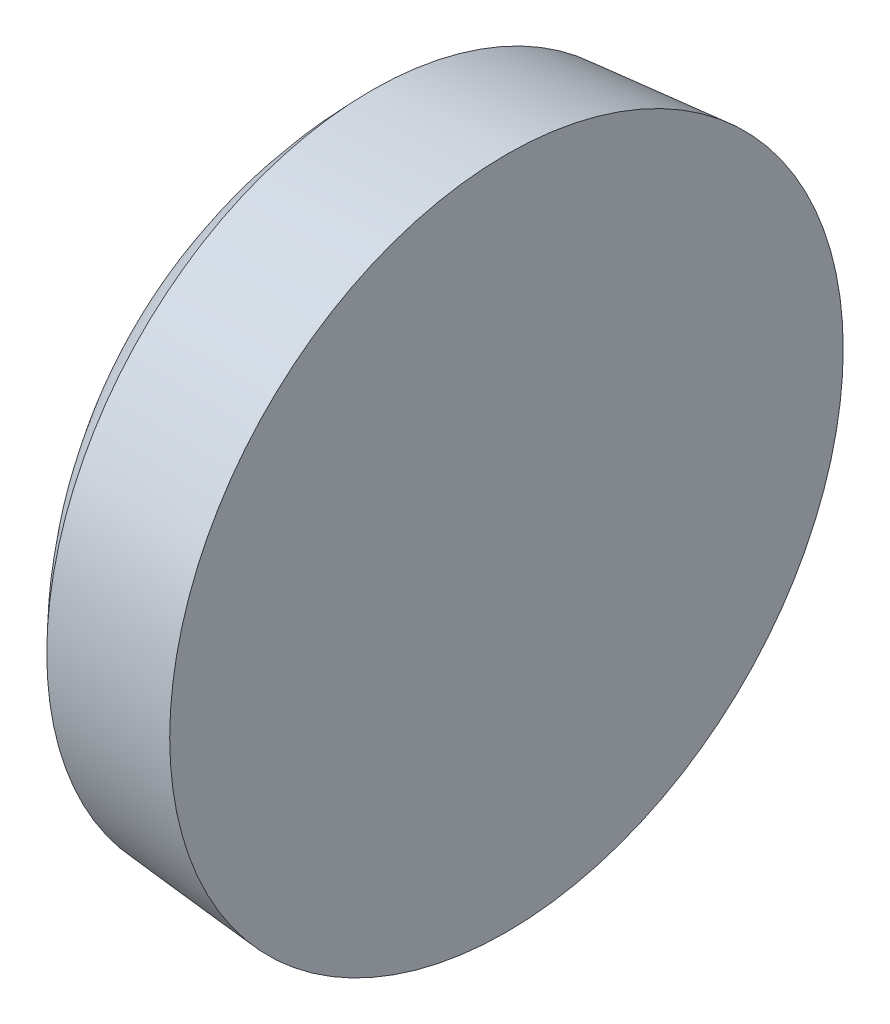
ISO-10303-21;
HEADER;
FILE_DESCRIPTION(('STEP AP214'),'2;1');
FILE_NAME('part.step','',(''),(''),'','','');
FILE_SCHEMA(('AUTOMOTIVE_DESIGN { 1 0 10303 214 1 1 1 1 }'));
ENDSEC;
DATA;
#1=APPLICATION_CONTEXT('core data for automotive mechanical design processes');
#2=APPLICATION_PROTOCOL_DEFINITION('international standard','automotive_design',2000,#1);
#3=PRODUCT_CONTEXT('',#1,'mechanical');
#4=PRODUCT('Part','Part','',(#3));
#5=PRODUCT_RELATED_PRODUCT_CATEGORY('part','',(#4));
#6=PRODUCT_DEFINITION_FORMATION('','',#4);
#7=PRODUCT_DEFINITION_CONTEXT('part definition',#1,'design');
#8=PRODUCT_DEFINITION('design','',#6,#7);
#9=PRODUCT_DEFINITION_SHAPE('','',#8);
#10=(LENGTH_UNIT() NAMED_UNIT(*) SI_UNIT(.MILLI.,.METRE.));
#11=(NAMED_UNIT(*) PLANE_ANGLE_UNIT() SI_UNIT($,.RADIAN.));
#12=(NAMED_UNIT(*) SI_UNIT($,.STERADIAN.) SOLID_ANGLE_UNIT());
#13=UNCERTAINTY_MEASURE_WITH_UNIT(LENGTH_MEASURE(1.E-05),#10,'distance_accuracy_value','');
#14=(GEOMETRIC_REPRESENTATION_CONTEXT(3) GLOBAL_UNCERTAINTY_ASSIGNED_CONTEXT((#13)) GLOBAL_UNIT_ASSIGNED_CONTEXT((#10,
#11,#12)) REPRESENTATION_CONTEXT('',''));
#15=CARTESIAN_POINT('',(0.,0.,0.));
#16=DIRECTION('',(0.,0.,1.));
#17=DIRECTION('',(1.,0.,0.));
#18=AXIS2_PLACEMENT_3D('',#15,#16,#17);
#19=CARTESIAN_POINT('',(71.8666666666667,6.9,10.));
#20=DIRECTION('',(-1.,0.,0.));
#21=DIRECTION('',(0.,0.,1.));
#22=AXIS2_PLACEMENT_3D('',#19,#20,#21);
#23=PLANE('',#22);
#24=DIRECTION('',(0.,0.,-1.));
#25=VECTOR('',#24,1.);
#26=CARTESIAN_POINT('',(71.8666666666667,7.85,10.));
#27=LINE('',#26,#25);
#28=CARTESIAN_POINT('',(71.8666666666667,7.85,9.82));
#29=VERTEX_POINT('',#28);
#30=CARTESIAN_POINT('',(71.8666666666667,7.85,10.18));
#31=VERTEX_POINT('',#30);
#32=EDGE_CURVE('E293',#29,#31,#27,.F.);
#33=ORIENTED_EDGE('',*,*,#32,.F.);
#34=DIRECTION('',(0.,1.,0.));
#35=VECTOR('',#34,1.);
#36=CARTESIAN_POINT('',(71.8666666666667,6.9,9.82));
#37=LINE('',#36,#35);
#38=CARTESIAN_POINT('',(71.8666666666667,7.08,9.82));
#39=VERTEX_POINT('',#38);
#40=EDGE_CURVE('E298',#39,#29,#37,.T.);
#41=ORIENTED_EDGE('',*,*,#40,.F.);
#42=DIRECTION('',(0.,0.,-1.));
#43=VECTOR('',#42,1.);
#44=CARTESIAN_POINT('',(71.8666666666667,7.08,10.));
#45=LINE('',#44,#43);
#46=CARTESIAN_POINT('',(71.8666666666667,7.08,9.05));
#47=VERTEX_POINT('',#46);
#48=EDGE_CURVE('E303',#47,#39,#45,.F.);
#49=ORIENTED_EDGE('',*,*,#48,.F.);
#50=DIRECTION('',(0.,1.,0.));
#51=VECTOR('',#50,1.);
#52=CARTESIAN_POINT('',(71.8666666666667,6.9,9.05));
#53=LINE('',#52,#51);
#54=CARTESIAN_POINT('',(71.8666666666667,6.72,9.05));
#55=VERTEX_POINT('',#54);
#56=EDGE_CURVE('E308',#55,#47,#53,.T.);
#57=ORIENTED_EDGE('',*,*,#56,.F.);
#58=DIRECTION('',(0.,0.,1.));
#59=VECTOR('',#58,1.);
#60=CARTESIAN_POINT('',(71.8666666666667,6.72,10.));
#61=LINE('',#60,#59);
#62=CARTESIAN_POINT('',(71.8666666666667,6.72,9.82));
#63=VERTEX_POINT('',#62);
#64=EDGE_CURVE('E313',#63,#55,#61,.F.);
#65=ORIENTED_EDGE('',*,*,#64,.F.);
#66=DIRECTION('',(0.,1.,0.));
#67=VECTOR('',#66,1.);
#68=CARTESIAN_POINT('',(71.8666666666667,6.9,9.82));
#69=LINE('',#68,#67);
#70=CARTESIAN_POINT('',(71.8666666666667,5.95,9.82));
#71=VERTEX_POINT('',#70);
#72=EDGE_CURVE('E318',#71,#63,#69,.T.);
#73=ORIENTED_EDGE('',*,*,#72,.F.);
#74=DIRECTION('',(0.,0.,-1.));
#75=VECTOR('',#74,1.);
#76=CARTESIAN_POINT('',(71.8666666666667,5.95,10.));
#77=LINE('',#76,#75);
#78=CARTESIAN_POINT('',(71.8666666666667,5.95,10.18));
#79=VERTEX_POINT('',#78);
#80=EDGE_CURVE('E267',#71,#79,#77,.F.);
#81=ORIENTED_EDGE('',*,*,#80,.T.);
#82=DIRECTION('',(0.,1.,0.));
#83=VECTOR('',#82,1.);
#84=CARTESIAN_POINT('',(71.8666666666667,6.9,10.18));
#85=LINE('',#84,#83);
#86=CARTESIAN_POINT('',(71.8666666666667,6.72,10.18));
#87=VERTEX_POINT('',#86);
#88=EDGE_CURVE('E264',#87,#79,#85,.F.);
#89=ORIENTED_EDGE('',*,*,#88,.F.);
#90=DIRECTION('',(0.,0.,1.));
#91=VECTOR('',#90,1.);
#92=CARTESIAN_POINT('',(71.8666666666667,6.72,10.));
#93=LINE('',#92,#91);
#94=CARTESIAN_POINT('',(71.8666666666667,6.72,10.95));
#95=VERTEX_POINT('',#94);
#96=EDGE_CURVE('E260',#95,#87,#93,.F.);
#97=ORIENTED_EDGE('',*,*,#96,.F.);
#98=DIRECTION('',(0.,1.,0.));
#99=VECTOR('',#98,1.);
#100=CARTESIAN_POINT('',(71.8666666666667,6.9,10.95));
#101=LINE('',#100,#99);
#102=CARTESIAN_POINT('',(71.8666666666667,7.08,10.95));
#103=VERTEX_POINT('',#102);
#104=EDGE_CURVE('E231',#95,#103,#101,.T.);
#105=ORIENTED_EDGE('',*,*,#104,.T.);
#106=DIRECTION('',(0.,0.,-1.));
#107=VECTOR('',#106,1.);
#108=CARTESIAN_POINT('',(71.8666666666667,7.08,10.));
#109=LINE('',#108,#107);
#110=CARTESIAN_POINT('',(71.8666666666667,7.08,10.18));
#111=VERTEX_POINT('',#110);
#112=EDGE_CURVE('E278',#111,#103,#109,.F.);
#113=ORIENTED_EDGE('',*,*,#112,.F.);
#114=DIRECTION('',(0.,1.,0.));
#115=VECTOR('',#114,1.);
#116=CARTESIAN_POINT('',(71.8666666666667,6.9,10.18));
#117=LINE('',#116,#115);
#118=EDGE_CURVE('E288',#31,#111,#117,.F.);
#119=ORIENTED_EDGE('',*,*,#118,.F.);
#120=EDGE_LOOP('',(#33,#41,#49,#57,#65,#73,#81,#89,#97,#105,#113,#119));
#121=FACE_BOUND('',#120,.T.);
#122=ADVANCED_FACE('F17',(#121),#23,.T.);
#123=CARTESIAN_POINT('',(71.2666666666667,6.72,10.));
#124=DIRECTION('',(0.,1.,0.));
#125=DIRECTION('',(0.,0.,1.));
#126=AXIS2_PLACEMENT_3D('',#123,#124,#125);
#127=PLANE('',#126);
#128=DIRECTION('',(1.,0.,0.));
#129=VECTOR('',#128,1.);
#130=CARTESIAN_POINT('',(71.2666666666667,6.72,10.95));
#131=LINE('',#130,#129);
#132=CARTESIAN_POINT('',(70.8437621434756,6.72,10.95));
#133=VERTEX_POINT('',#132);
#134=EDGE_CURVE('E89',#133,#95,#131,.T.);
#135=ORIENTED_EDGE('',*,*,#134,.T.);
#136=ORIENTED_EDGE('',*,*,#96,.T.);
#137=DIRECTION('',(-1.,0.,0.));
#138=VECTOR('',#137,1.);
#139=CARTESIAN_POINT('',(71.2666666666667,6.72,10.18));
#140=LINE('',#139,#138);
#141=CARTESIAN_POINT('',(70.6785690968727,6.72,10.18));
#142=VERTEX_POINT('',#141);
#143=EDGE_CURVE('E224',#142,#87,#140,.F.);
#144=ORIENTED_EDGE('',*,*,#143,.F.);
#145=CARTESIAN_POINT('',(70.8437621434756,6.72,10.95));
#146=CARTESIAN_POINT('',(70.8322171292822,6.72,10.9189995540506));
#147=CARTESIAN_POINT('',(70.8212377468981,6.72,10.8877884938067));
#148=CARTESIAN_POINT('',(70.8004645483596,6.72,10.8251104536469));
#149=CARTESIAN_POINT('',(70.7906662413493,6.72,10.7936449620741));
#150=CARTESIAN_POINT('',(70.7722427007091,6.72,10.7304618501356));
#151=CARTESIAN_POINT('',(70.7636144610796,6.72,10.6987451062672));
#152=CARTESIAN_POINT('',(70.747522711913,6.72,10.6350619663155));
#153=CARTESIAN_POINT('',(70.7400576830911,6.72,10.6030959541242));
#154=CARTESIAN_POINT('',(70.7262885047045,6.72,10.5389148788568));
#155=CARTESIAN_POINT('',(70.7199843551398,6.72,10.5066998157808));
#156=CARTESIAN_POINT('',(70.7085376077745,6.72,10.4420201537524));
#157=CARTESIAN_POINT('',(70.7033965530294,6.72,10.4095552817086));
#158=CARTESIAN_POINT('',(70.6942815043555,6.72,10.3443751591893));
#159=CARTESIAN_POINT('',(70.6903106114274,6.72,10.3116594750372));
#160=CARTESIAN_POINT('',(70.6835456245179,6.72,10.2459761632456));
#161=CARTESIAN_POINT('',(70.6807562366993,6.72,10.2130080508538));
#162=CARTESIAN_POINT('',(70.6785690968726,6.72,10.18));
#163=B_SPLINE_CURVE_WITH_KNOTS('',3,(#145,#146,#147,#148,#149,#150,#151,#152,#153,#154,#155,
#156,#157,#158,#159,#160,#161,#162),.UNSPECIFIED.,.F.,.F.,(4,2,2,2,2,2,2,2,4),(0.,
0.0992357442434171,0.198081387639275,0.296668072480497,0.395124892694101,0.493581712907701,
0.592168397748929,0.691014041144783,0.790249785388203),.UNSPECIFIED.);
#164=EDGE_CURVE('E20',#133,#142,#163,.T.);
#165=ORIENTED_EDGE('',*,*,#164,.F.);
#166=EDGE_LOOP('',(#135,#136,#144,#165));
#167=FACE_BOUND('',#166,.T.);
#168=ADVANCED_FACE('F221',(#167),#127,.T.);
#169=CARTESIAN_POINT('',(71.2666666666667,6.9,10.18));
#170=DIRECTION('',(0.,0.,-1.));
#171=DIRECTION('',(-1.,0.,0.));
#172=AXIS2_PLACEMENT_3D('',#169,#170,#171);
#173=PLANE('',#172);
#174=ORIENTED_EDGE('',*,*,#88,.T.);
#175=DIRECTION('',(1.,0.,0.));
#176=VECTOR('',#175,1.);
#177=CARTESIAN_POINT('',(71.2666666666667,5.95,10.18));
#178=LINE('',#177,#176);
#179=CARTESIAN_POINT('',(70.8437621434756,5.95,10.18));
#180=VERTEX_POINT('',#179);
#181=EDGE_CURVE('E324',#79,#180,#178,.F.);
#182=ORIENTED_EDGE('',*,*,#181,.T.);
#183=CARTESIAN_POINT('',(70.6785690968726,6.71999999999999,10.18));
#184=CARTESIAN_POINT('',(70.6842232755615,6.63440991744418,10.18));
#185=CARTESIAN_POINT('',(70.6939547629615,6.54909652262231,10.18));
#186=CARTESIAN_POINT('',(70.721321880478,6.38034093840231,10.18));
#187=CARTESIAN_POINT('',(70.7389034345171,6.29688998051804,10.18));
#188=CARTESIAN_POINT('',(70.7836325640795,6.12495750840954,10.18));
#189=CARTESIAN_POINT('',(70.8114686271752,6.03665468899654,10.18));
#190=CARTESIAN_POINT('',(70.8437621434756,5.94999999999999,10.18));
#191=B_SPLINE_CURVE_WITH_KNOTS('',3,(#183,#184,#185,#186,#187,#188,#189,#190),.UNSPECIFIED.,.F.,
.F.,(4,2,2,4),(0.,0.257221658829344,0.512698117737358,0.789983486231619),.UNSPECIFIED.);
#192=EDGE_CURVE('E213',#142,#180,#191,.T.);
#193=ORIENTED_EDGE('',*,*,#192,.F.);
#194=ORIENTED_EDGE('',*,*,#143,.T.);
#195=EDGE_LOOP('',(#174,#182,#193,#194));
#196=FACE_BOUND('',#195,.T.);
#197=ADVANCED_FACE('F204',(#196),#173,.T.);
#198=CARTESIAN_POINT('',(71.2666666666667,5.95,10.));
#199=DIRECTION('',(0.,-1.,0.));
#200=DIRECTION('',(0.,0.,-1.));
#201=AXIS2_PLACEMENT_3D('',#198,#199,#200);
#202=PLANE('',#201);
#203=ORIENTED_EDGE('',*,*,#181,.F.);
#204=ORIENTED_EDGE('',*,*,#80,.F.);
#205=DIRECTION('',(1.,0.,0.));
#206=VECTOR('',#205,1.);
#207=CARTESIAN_POINT('',(71.2666666666667,5.95,9.82));
#208=LINE('',#207,#206);
#209=CARTESIAN_POINT('',(70.8437621434756,5.94999999999999,9.82));
#210=VERTEX_POINT('',#209);
#211=EDGE_CURVE('E320',#210,#71,#208,.T.);
#212=ORIENTED_EDGE('',*,*,#211,.F.);
#213=CARTESIAN_POINT('',(70.8437621434756,5.95,10.18));
#214=CARTESIAN_POINT('',(70.8395337477772,5.94999999999998,10.12));
#215=CARTESIAN_POINT('',(70.8374195499281,5.94999999999998,10.06));
#216=CARTESIAN_POINT('',(70.8374195499281,5.95000000000002,9.93999999999996));
#217=CARTESIAN_POINT('',(70.8395337477772,5.95000000000006,9.87999999999995));
#218=CARTESIAN_POINT('',(70.8437621434755,5.95000000000011,9.81999999999994));
#219=B_SPLINE_CURVE_WITH_KNOTS('',3,(#213,#214,#215,#216,#217,#218),.UNSPECIFIED.,.F.,.F.,(4,2,
4),(0.,0.18011171114872,0.360223422297441),.UNSPECIFIED.);
#220=EDGE_CURVE('E207',#180,#210,#219,.T.);
#221=ORIENTED_EDGE('',*,*,#220,.F.);
#222=EDGE_LOOP('',(#203,#204,#212,#221));
#223=FACE_BOUND('',#222,.T.);
#224=ADVANCED_FACE('F199',(#223),#202,.F.);
#225=CARTESIAN_POINT('',(71.2666666666667,6.9,9.82));
#226=DIRECTION('',(0.,0.,1.));
#227=DIRECTION('',(1.,0.,0.));
#228=AXIS2_PLACEMENT_3D('',#225,#226,#227);
#229=PLANE('',#228);
#230=ORIENTED_EDGE('',*,*,#72,.T.);
#231=DIRECTION('',(1.,0.,0.));
#232=VECTOR('',#231,1.);
#233=CARTESIAN_POINT('',(71.2666666666667,6.72,9.82));
#234=LINE('',#233,#232);
#235=CARTESIAN_POINT('',(70.6785690968727,6.72,9.82));
#236=VERTEX_POINT('',#235);
#237=EDGE_CURVE('E315',#236,#63,#234,.T.);
#238=ORIENTED_EDGE('',*,*,#237,.F.);
#239=CARTESIAN_POINT('',(70.8437621434756,5.94999999999999,9.82));
#240=CARTESIAN_POINT('',(70.8322171292822,5.98100044594941,9.82));
#241=CARTESIAN_POINT('',(70.8212377468981,6.01221150619326,9.82));
#242=CARTESIAN_POINT('',(70.8004645483596,6.07488954635315,9.82));
#243=CARTESIAN_POINT('',(70.7906662413493,6.10635503792594,9.82));
#244=CARTESIAN_POINT('',(70.7722427007091,6.1695381498644,9.82));
#245=CARTESIAN_POINT('',(70.7636144610796,6.20125489373276,9.82));
#246=CARTESIAN_POINT('',(70.747522711913,6.26493803368449,9.82));
#247=CARTESIAN_POINT('',(70.7400576830911,6.29690404587581,9.82));
#248=CARTESIAN_POINT('',(70.7262885047045,6.36108512114316,9.82));
#249=CARTESIAN_POINT('',(70.7199843551398,6.3933001842192,9.82));
#250=CARTESIAN_POINT('',(70.7085376077745,6.45797984624761,9.82));
#251=CARTESIAN_POINT('',(70.7033965530294,6.49044471829143,9.82));
#252=CARTESIAN_POINT('',(70.6942815043555,6.55562484081068,9.82));
#253=CARTESIAN_POINT('',(70.6903106114274,6.58834052496277,9.82));
#254=CARTESIAN_POINT('',(70.6835456245179,6.65402383675439,9.82));
#255=CARTESIAN_POINT('',(70.6807562366993,6.68699194914621,9.82));
#256=CARTESIAN_POINT('',(70.6785690968726,6.72,9.82));
#257=B_SPLINE_CURVE_WITH_KNOTS('',3,(#239,#240,#241,#242,#243,#244,#245,#246,#247,#248,#249,
#250,#251,#252,#253,#254,#255,#256),.UNSPECIFIED.,.F.,.F.,(4,2,2,2,2,2,2,2,4),(0.,
0.0992357442434187,0.198081387639276,0.2966680724805,0.395124892694102,0.493581712907702,
0.59216839774893,0.691014041144785,0.790249785388205),.UNSPECIFIED.);
#258=EDGE_CURVE('E184',#210,#236,#257,.T.);
#259=ORIENTED_EDGE('',*,*,#258,.F.);
#260=ORIENTED_EDGE('',*,*,#211,.T.);
#261=EDGE_LOOP('',(#230,#238,#259,#260));
#262=FACE_BOUND('',#261,.T.);
#263=ADVANCED_FACE('F194',(#262),#229,.T.);
#264=CARTESIAN_POINT('',(71.2666666666667,6.72,10.));
#265=DIRECTION('',(0.,1.,0.));
#266=DIRECTION('',(0.,0.,1.));
#267=AXIS2_PLACEMENT_3D('',#264,#265,#266);
#268=PLANE('',#267);
#269=DIRECTION('',(1.,0.,0.));
#270=VECTOR('',#269,1.);
#271=CARTESIAN_POINT('',(71.2666666666667,6.72,9.05));
#272=LINE('',#271,#270);
#273=CARTESIAN_POINT('',(70.8437621434756,6.72,9.05));
#274=VERTEX_POINT('',#273);
#275=EDGE_CURVE('E310',#274,#55,#272,.T.);
#276=ORIENTED_EDGE('',*,*,#275,.F.);
#277=CARTESIAN_POINT('',(70.6785690968726,6.72,9.81999999999999));
#278=CARTESIAN_POINT('',(70.6842232755615,6.72,9.73440991744418));
#279=CARTESIAN_POINT('',(70.6939547629615,6.72,9.6490965226223));
#280=CARTESIAN_POINT('',(70.721321880478,6.72,9.48034093840231));
#281=CARTESIAN_POINT('',(70.7389034345171,6.72,9.39688998051804));
#282=CARTESIAN_POINT('',(70.7836325640795,6.72,9.22495750840954));
#283=CARTESIAN_POINT('',(70.8114686271752,6.72,9.13665468899654));
#284=CARTESIAN_POINT('',(70.8437621434756,6.72,9.04999999999999));
#285=B_SPLINE_CURVE_WITH_KNOTS('',3,(#277,#278,#279,#280,#281,#282,#283,#284),.UNSPECIFIED.,.F.,
.F.,(4,2,2,4),(0.,0.257221658829345,0.512698117737359,0.789983486231615),.UNSPECIFIED.);
#286=EDGE_CURVE('E176',#236,#274,#285,.T.);
#287=ORIENTED_EDGE('',*,*,#286,.F.);
#288=ORIENTED_EDGE('',*,*,#237,.T.);
#289=ORIENTED_EDGE('',*,*,#64,.T.);
#290=EDGE_LOOP('',(#276,#287,#288,#289));
#291=FACE_BOUND('',#290,.T.);
#292=ADVANCED_FACE('F191',(#291),#268,.T.);
#293=CARTESIAN_POINT('',(71.2666666666667,6.9,9.05));
#294=DIRECTION('',(0.,0.,1.));
#295=DIRECTION('',(1.,0.,0.));
#296=AXIS2_PLACEMENT_3D('',#293,#294,#295);
#297=PLANE('',#296);
#298=DIRECTION('',(1.,0.,0.));
#299=VECTOR('',#298,1.);
#300=CARTESIAN_POINT('',(71.2666666666667,7.08,9.05));
#301=LINE('',#300,#299);
#302=CARTESIAN_POINT('',(70.8437621434756,7.08,9.05));
#303=VERTEX_POINT('',#302);
#304=EDGE_CURVE('E305',#303,#47,#301,.T.);
#305=ORIENTED_EDGE('',*,*,#304,.F.);
#306=CARTESIAN_POINT('',(70.8437621434756,7.08,9.05));
#307=CARTESIAN_POINT('',(70.8374195499281,6.99011174581384,9.05));
#308=CARTESIAN_POINT('',(70.8374195499281,6.9,9.05));
#309=B_SPLINE_CURVE_WITH_KNOTS('',2,(#306,#307,#308),.UNSPECIFIED.,.F.,.F.,(3,3),(0.,1.),.UNSPECIFIED.);
#310=CARTESIAN_POINT('',(70.8374195499281,6.9,9.05));
#311=VERTEX_POINT('',#310);
#312=EDGE_CURVE('E175',#311,#303,#309,.F.);
#313=ORIENTED_EDGE('',*,*,#312,.F.);
#314=CARTESIAN_POINT('',(70.8374195499281,6.9,9.05));
#315=CARTESIAN_POINT('',(70.8374195499281,6.80988825418617,9.05));
#316=CARTESIAN_POINT('',(70.8437621434756,6.72,9.05));
#317=B_SPLINE_CURVE_WITH_KNOTS('',2,(#314,#315,#316),.UNSPECIFIED.,.F.,.F.,(3,3),(0.,1.),.UNSPECIFIED.);
#318=EDGE_CURVE('E183',#274,#311,#317,.F.);
#319=ORIENTED_EDGE('',*,*,#318,.F.);
#320=ORIENTED_EDGE('',*,*,#275,.T.);
#321=ORIENTED_EDGE('',*,*,#56,.T.);
#322=EDGE_LOOP('',(#305,#313,#319,#320,#321));
#323=FACE_BOUND('',#322,.T.);
#324=ADVANCED_FACE('F164',(#323),#297,.T.);
#325=CARTESIAN_POINT('',(71.2666666666667,7.08,10.));
#326=DIRECTION('',(0.,-1.,0.));
#327=DIRECTION('',(0.,0.,-1.));
#328=AXIS2_PLACEMENT_3D('',#325,#326,#327);
#329=PLANE('',#328);
#330=ORIENTED_EDGE('',*,*,#304,.T.);
#331=ORIENTED_EDGE('',*,*,#48,.T.);
#332=DIRECTION('',(1.,0.,0.));
#333=VECTOR('',#332,1.);
#334=CARTESIAN_POINT('',(71.2666666666667,7.08,9.82));
#335=LINE('',#334,#333);
#336=CARTESIAN_POINT('',(70.6785690968727,7.08,9.82));
#337=VERTEX_POINT('',#336);
#338=EDGE_CURVE('E300',#337,#39,#335,.T.);
#339=ORIENTED_EDGE('',*,*,#338,.F.);
#340=CARTESIAN_POINT('',(70.8437621434756,7.08,9.04999999999999));
#341=CARTESIAN_POINT('',(70.8322171292822,7.08,9.08100044594941));
#342=CARTESIAN_POINT('',(70.8212377468981,7.08,9.11221150619326));
#343=CARTESIAN_POINT('',(70.8004645483596,7.08,9.17488954635315));
#344=CARTESIAN_POINT('',(70.7906662413493,7.08,9.20635503792594));
#345=CARTESIAN_POINT('',(70.7722427007091,7.08,9.2695381498644));
#346=CARTESIAN_POINT('',(70.7636144610796,7.08,9.30125489373275));
#347=CARTESIAN_POINT('',(70.747522711913,7.08,9.36493803368449));
#348=CARTESIAN_POINT('',(70.7400576830911,7.08,9.39690404587581));
#349=CARTESIAN_POINT('',(70.7262885047045,7.08,9.46108512114316));
#350=CARTESIAN_POINT('',(70.7199843551398,7.08,9.4933001842192));
#351=CARTESIAN_POINT('',(70.7085376077745,7.08,9.5579798462476));
#352=CARTESIAN_POINT('',(70.7033965530294,7.08,9.59044471829143));
#353=CARTESIAN_POINT('',(70.6942815043555,7.08,9.65562484081068));
#354=CARTESIAN_POINT('',(70.6903106114274,7.08,9.68834052496276));
#355=CARTESIAN_POINT('',(70.6835456245179,7.08,9.75402383675439));
#356=CARTESIAN_POINT('',(70.6807562366993,7.08,9.78699194914621));
#357=CARTESIAN_POINT('',(70.6785690968726,7.08,9.81999999999999));
#358=B_SPLINE_CURVE_WITH_KNOTS('',3,(#340,#341,#342,#343,#344,#345,#346,#347,#348,#349,#350,
#351,#352,#353,#354,#355,#356,#357),.UNSPECIFIED.,.F.,.F.,(4,2,2,2,2,2,2,2,4),(0.,
0.0992357442434171,0.198081387639275,0.296668072480497,0.395124892694099,0.4935817129077,
0.592168397748929,0.691014041144783,0.790249785388203),.UNSPECIFIED.);
#359=EDGE_CURVE('E168',#303,#337,#358,.T.);
#360=ORIENTED_EDGE('',*,*,#359,.F.);
#361=EDGE_LOOP('',(#330,#331,#339,#360));
#362=FACE_BOUND('',#361,.T.);
#363=ADVANCED_FACE('F159',(#362),#329,.T.);
#364=CARTESIAN_POINT('',(71.2666666666667,6.9,9.82));
#365=DIRECTION('',(0.,0.,1.));
#366=DIRECTION('',(1.,0.,0.));
#367=AXIS2_PLACEMENT_3D('',#364,#365,#366);
#368=PLANE('',#367);
#369=ORIENTED_EDGE('',*,*,#40,.T.);
#370=DIRECTION('',(1.,0.,0.));
#371=VECTOR('',#370,1.);
#372=CARTESIAN_POINT('',(71.2666666666667,7.85,9.82));
#373=LINE('',#372,#371);
#374=CARTESIAN_POINT('',(70.8437621434756,7.85,9.82));
#375=VERTEX_POINT('',#374);
#376=EDGE_CURVE('E295',#375,#29,#373,.T.);
#377=ORIENTED_EDGE('',*,*,#376,.F.);
#378=CARTESIAN_POINT('',(70.6785690968726,7.08000000000001,9.82));
#379=CARTESIAN_POINT('',(70.6842232755615,7.16559008255582,9.82));
#380=CARTESIAN_POINT('',(70.6939547629615,7.2509034773777,9.82));
#381=CARTESIAN_POINT('',(70.721321880478,7.41965906159769,9.82));
#382=CARTESIAN_POINT('',(70.7389034345171,7.50311001948196,9.82));
#383=CARTESIAN_POINT('',(70.7836325640795,7.67504249159046,9.82));
#384=CARTESIAN_POINT('',(70.8114686271752,7.76334531100346,9.82));
#385=CARTESIAN_POINT('',(70.8437621434756,7.85000000000001,9.82));
#386=B_SPLINE_CURVE_WITH_KNOTS('',3,(#378,#379,#380,#381,#382,#383,#384,#385),.UNSPECIFIED.,.F.,
.F.,(4,2,2,4),(0.,0.257221658829344,0.512698117737359,0.789983486231618),.UNSPECIFIED.);
#387=EDGE_CURVE('E144',#337,#375,#386,.T.);
#388=ORIENTED_EDGE('',*,*,#387,.F.);
#389=ORIENTED_EDGE('',*,*,#338,.T.);
#390=EDGE_LOOP('',(#369,#377,#388,#389));
#391=FACE_BOUND('',#390,.T.);
#392=ADVANCED_FACE('F154',(#391),#368,.T.);
#393=CARTESIAN_POINT('',(71.2666666666667,7.85,10.));
#394=DIRECTION('',(0.,-1.,0.));
#395=DIRECTION('',(0.,0.,-1.));
#396=AXIS2_PLACEMENT_3D('',#393,#394,#395);
#397=PLANE('',#396);
#398=ORIENTED_EDGE('',*,*,#32,.T.);
#399=DIRECTION('',(-1.,0.,0.));
#400=VECTOR('',#399,1.);
#401=CARTESIAN_POINT('',(71.2666666666667,7.85,10.18));
#402=LINE('',#401,#400);
#403=CARTESIAN_POINT('',(70.8437621434756,7.85,10.18));
#404=VERTEX_POINT('',#403);
#405=EDGE_CURVE('E290',#404,#31,#402,.F.);
#406=ORIENTED_EDGE('',*,*,#405,.F.);
#407=CARTESIAN_POINT('',(70.8437621434756,7.85,9.82));
#408=CARTESIAN_POINT('',(70.8395337477772,7.85000000000001,9.88000000000001));
#409=CARTESIAN_POINT('',(70.8374195499281,7.85000000000001,9.94000000000002));
#410=CARTESIAN_POINT('',(70.8374195499281,7.84999999999999,10.06));
#411=CARTESIAN_POINT('',(70.8395337477772,7.84999999999997,10.1200000000001));
#412=CARTESIAN_POINT('',(70.8437621434755,7.84999999999994,10.1800000000001));
#413=B_SPLINE_CURVE_WITH_KNOTS('',3,(#407,#408,#409,#410,#411,#412),.UNSPECIFIED.,.F.,.F.,(4,2,
4),(0.,0.180111711148723,0.360223422297444),.UNSPECIFIED.);
#414=EDGE_CURVE('E137',#375,#404,#413,.T.);
#415=ORIENTED_EDGE('',*,*,#414,.F.);
#416=ORIENTED_EDGE('',*,*,#376,.T.);
#417=EDGE_LOOP('',(#398,#406,#415,#416));
#418=FACE_BOUND('',#417,.T.);
#419=ADVANCED_FACE('F151',(#418),#397,.T.);
#420=CARTESIAN_POINT('',(71.2666666666667,6.9,10.18));
#421=DIRECTION('',(0.,0.,-1.));
#422=DIRECTION('',(-1.,0.,0.));
#423=AXIS2_PLACEMENT_3D('',#420,#421,#422);
#424=PLANE('',#423);
#425=ORIENTED_EDGE('',*,*,#118,.T.);
#426=DIRECTION('',(1.,0.,0.));
#427=VECTOR('',#426,1.);
#428=CARTESIAN_POINT('',(71.2666666666667,7.08,10.18));
#429=LINE('',#428,#427);
#430=CARTESIAN_POINT('',(70.6785690968727,7.08,10.18));
#431=VERTEX_POINT('',#430);
#432=EDGE_CURVE('E280',#431,#111,#429,.T.);
#433=ORIENTED_EDGE('',*,*,#432,.F.);
#434=CARTESIAN_POINT('',(70.8437621434756,7.85000000000001,10.18));
#435=CARTESIAN_POINT('',(70.8322171292822,7.81899955405059,10.18));
#436=CARTESIAN_POINT('',(70.8212377468981,7.78778849380673,10.18));
#437=CARTESIAN_POINT('',(70.8004645483596,7.72511045364685,10.18));
#438=CARTESIAN_POINT('',(70.7906662413493,7.69364496207406,10.18));
#439=CARTESIAN_POINT('',(70.7722427007091,7.6304618501356,10.18));
#440=CARTESIAN_POINT('',(70.7636144610796,7.59874510626724,10.18));
#441=CARTESIAN_POINT('',(70.747522711913,7.53506196631551,10.18));
#442=CARTESIAN_POINT('',(70.7400576830911,7.50309595412419,10.18));
#443=CARTESIAN_POINT('',(70.7262885047045,7.43891487885684,10.18));
#444=CARTESIAN_POINT('',(70.7199843551398,7.40669981578081,10.18));
#445=CARTESIAN_POINT('',(70.7085376077745,7.3420201537524,10.18));
#446=CARTESIAN_POINT('',(70.7033965530294,7.30955528170858,10.18));
#447=CARTESIAN_POINT('',(70.6942815043555,7.24437515918932,10.18));
#448=CARTESIAN_POINT('',(70.6903106114274,7.21165947503724,10.18));
#449=CARTESIAN_POINT('',(70.6835456245179,7.14597616324561,10.18));
#450=CARTESIAN_POINT('',(70.6807562366993,7.11300805085379,10.18));
#451=CARTESIAN_POINT('',(70.6785690968726,7.08000000000001,10.18));
#452=B_SPLINE_CURVE_WITH_KNOTS('',3,(#434,#435,#436,#437,#438,#439,#440,#441,#442,#443,#444,
#445,#446,#447,#448,#449,#450,#451),.UNSPECIFIED.,.F.,.F.,(4,2,2,2,2,2,2,2,4),(0.,
0.0992357442434187,0.198081387639275,0.296668072480498,0.395124892694101,0.493581712907699,
0.592168397748928,0.691014041144783,0.790249785388203),.UNSPECIFIED.);
#453=EDGE_CURVE('E100',#404,#431,#452,.T.);
#454=ORIENTED_EDGE('',*,*,#453,.F.);
#455=ORIENTED_EDGE('',*,*,#405,.T.);
#456=EDGE_LOOP('',(#425,#433,#454,#455));
#457=FACE_BOUND('',#456,.T.);
#458=ADVANCED_FACE('F123',(#457),#424,.T.);
#459=CARTESIAN_POINT('',(71.2666666666667,7.08,10.));
#460=DIRECTION('',(0.,-1.,0.));
#461=DIRECTION('',(0.,0.,-1.));
#462=AXIS2_PLACEMENT_3D('',#459,#460,#461);
#463=PLANE('',#462);
#464=DIRECTION('',(1.,0.,0.));
#465=VECTOR('',#464,1.);
#466=CARTESIAN_POINT('',(71.2666666666667,7.08,10.95));
#467=LINE('',#466,#465);
#468=CARTESIAN_POINT('',(70.8437621434756,7.08,10.95));
#469=VERTEX_POINT('',#468);
#470=EDGE_CURVE('E40',#103,#469,#467,.F.);
#471=ORIENTED_EDGE('',*,*,#470,.T.);
#472=CARTESIAN_POINT('',(70.6785690968726,7.08,10.18));
#473=CARTESIAN_POINT('',(70.6842232755615,7.08,10.2655900825558));
#474=CARTESIAN_POINT('',(70.6939547629615,7.08,10.3509034773777));
#475=CARTESIAN_POINT('',(70.721321880478,7.08,10.5196590615977));
#476=CARTESIAN_POINT('',(70.7389034345171,7.08,10.603110019482));
#477=CARTESIAN_POINT('',(70.7836325640795,7.08,10.7750424915905));
#478=CARTESIAN_POINT('',(70.8114686271752,7.08,10.8633453110035));
#479=CARTESIAN_POINT('',(70.8437621434756,7.08,10.95));
#480=B_SPLINE_CURVE_WITH_KNOTS('',3,(#472,#473,#474,#475,#476,#477,#478,#479),.UNSPECIFIED.,.F.,
.F.,(4,2,2,4),(0.,0.257221658829345,0.512698117737359,0.78998348623162),.UNSPECIFIED.);
#481=EDGE_CURVE('E96',#431,#469,#480,.T.);
#482=ORIENTED_EDGE('',*,*,#481,.F.);
#483=ORIENTED_EDGE('',*,*,#432,.T.);
#484=ORIENTED_EDGE('',*,*,#112,.T.);
#485=EDGE_LOOP('',(#471,#482,#483,#484));
#486=FACE_BOUND('',#485,.T.);
#487=ADVANCED_FACE('F115',(#486),#463,.T.);
#488=CARTESIAN_POINT('',(71.2666666666667,6.9,10.95));
#489=DIRECTION('',(0.,0.,1.));
#490=DIRECTION('',(1.,0.,0.));
#491=AXIS2_PLACEMENT_3D('',#488,#489,#490);
#492=PLANE('',#491);
#493=ORIENTED_EDGE('',*,*,#470,.F.);
#494=ORIENTED_EDGE('',*,*,#104,.F.);
#495=ORIENTED_EDGE('',*,*,#134,.F.);
#496=CARTESIAN_POINT('',(70.8374195499281,6.9,10.95));
#497=CARTESIAN_POINT('',(70.8374195499281,6.80988825418617,10.95));
#498=CARTESIAN_POINT('',(70.8437621434756,6.72,10.95));
#499=B_SPLINE_CURVE_WITH_KNOTS('',2,(#496,#497,#498),.UNSPECIFIED.,.F.,.F.,(3,3),(0.,1.),.UNSPECIFIED.);
#500=CARTESIAN_POINT('',(70.8374195499281,6.9,10.95));
#501=VERTEX_POINT('',#500);
#502=EDGE_CURVE('E82',#501,#133,#499,.T.);
#503=ORIENTED_EDGE('',*,*,#502,.F.);
#504=CARTESIAN_POINT('',(70.8437621434756,7.08,10.95));
#505=CARTESIAN_POINT('',(70.8374195499281,6.99011174581383,10.95));
#506=CARTESIAN_POINT('',(70.8374195499281,6.9,10.95));
#507=B_SPLINE_CURVE_WITH_KNOTS('',2,(#504,#505,#506),.UNSPECIFIED.,.F.,.F.,(3,3),(0.,1.),.UNSPECIFIED.);
#508=EDGE_CURVE('E85',#469,#501,#507,.T.);
#509=ORIENTED_EDGE('',*,*,#508,.F.);
#510=EDGE_LOOP('',(#493,#494,#495,#503,#509));
#511=FACE_BOUND('',#510,.T.);
#512=ADVANCED_FACE('F84',(#511),#492,.F.);
#513=CARTESIAN_POINT('',(73.394751046113,6.9,10.));
#514=DIRECTION('',(1.,0.,0.));
#515=DIRECTION('',(0.,1.,0.));
#516=AXIS2_PLACEMENT_3D('',#513,#514,#515);
#517=SPHERICAL_SURFACE('',#516,2.72808437944638);
#518=CARTESIAN_POINT('',(71.4666666666517,6.9,10.));
#519=DIRECTION('',(1.,0.,0.));
#520=DIRECTION('',(0.,0.,1.));
#521=AXIS2_PLACEMENT_3D('',#518,#519,#520);
#522=CIRCLE('',#521,1.93000906917518);
#523=CARTESIAN_POINT('',(71.4666666666517,6.90000000000007,11.9300090691752));
#524=VERTEX_POINT('',#523);
#525=EDGE_CURVE('E31',#524,#524,#522,.T.);
#526=ORIENTED_EDGE('',*,*,#525,.F.);
#527=EDGE_LOOP('',(#526));
#528=FACE_BOUND('',#527,.T.);
#529=ORIENTED_EDGE('',*,*,#481,.T.);
#530=ORIENTED_EDGE('',*,*,#508,.T.);
#531=ORIENTED_EDGE('',*,*,#502,.T.);
#532=ORIENTED_EDGE('',*,*,#164,.T.);
#533=ORIENTED_EDGE('',*,*,#192,.T.);
#534=ORIENTED_EDGE('',*,*,#220,.T.);
#535=ORIENTED_EDGE('',*,*,#258,.T.);
#536=ORIENTED_EDGE('',*,*,#286,.T.);
#537=ORIENTED_EDGE('',*,*,#318,.T.);
#538=ORIENTED_EDGE('',*,*,#312,.T.);
#539=ORIENTED_EDGE('',*,*,#359,.T.);
#540=ORIENTED_EDGE('',*,*,#387,.T.);
#541=ORIENTED_EDGE('',*,*,#414,.T.);
#542=ORIENTED_EDGE('',*,*,#453,.T.);
#543=EDGE_LOOP('',(#529,#530,#531,#532,#533,#534,#535,#536,#537,#538,#539,#540,#541,#542));
#544=FACE_BOUND('',#543,.T.);
#545=ADVANCED_FACE('F94',(#528,#544),#517,.T.);
#546=CARTESIAN_POINT('',(72.2666666666782,6.9,10.));
#547=DIRECTION('',(1.,0.,0.));
#548=DIRECTION('',(0.,0.,-1.));
#549=AXIS2_PLACEMENT_3D('',#546,#547,#548);
#550=CONICAL_SURFACE('',#549,2.00000000000045,0.0872664626024547);
#551=CARTESIAN_POINT('',(72.2666666666782,6.9,10.));
#552=DIRECTION('',(1.,0.,0.));
#553=DIRECTION('',(0.,0.,-1.));
#554=AXIS2_PLACEMENT_3D('',#551,#552,#553);
#555=CIRCLE('',#554,2.00000000000045);
#556=CARTESIAN_POINT('',(72.2666666666782,6.9,7.99999999999955));
#557=VERTEX_POINT('',#556);
#558=EDGE_CURVE('E11',#557,#557,#555,.T.);
#559=ORIENTED_EDGE('',*,*,#558,.F.);
#560=EDGE_LOOP('',(#559));
#561=FACE_BOUND('',#560,.T.);
#562=ORIENTED_EDGE('',*,*,#525,.T.);
#563=EDGE_LOOP('',(#562));
#564=FACE_BOUND('',#563,.T.);
#565=ADVANCED_FACE('F402',(#561,#564),#550,.T.);
#566=CARTESIAN_POINT('',(72.2666666666667,6.9,11.));
#567=DIRECTION('',(1.,0.,0.));
#568=DIRECTION('',(0.,0.,-1.));
#569=AXIS2_PLACEMENT_3D('',#566,#567,#568);
#570=PLANE('',#569);
#571=ORIENTED_EDGE('',*,*,#558,.T.);
#572=EDGE_LOOP('',(#571));
#573=FACE_BOUND('',#572,.T.);
#574=ADVANCED_FACE('F400',(#573),#570,.T.);
#575=CLOSED_SHELL('',(#122,#168,#197,#224,#263,#292,#324,#363,#392,#419,#458,#487,#512,#545,
#565,#574));
#576=MANIFOLD_SOLID_BREP('B1',#575);
#577=ADVANCED_BREP_SHAPE_REPRESENTATION('',(#18,#576),#14);
#578=SHAPE_DEFINITION_REPRESENTATION(#9,#577);
ENDSEC;
END-ISO-10303-21;
